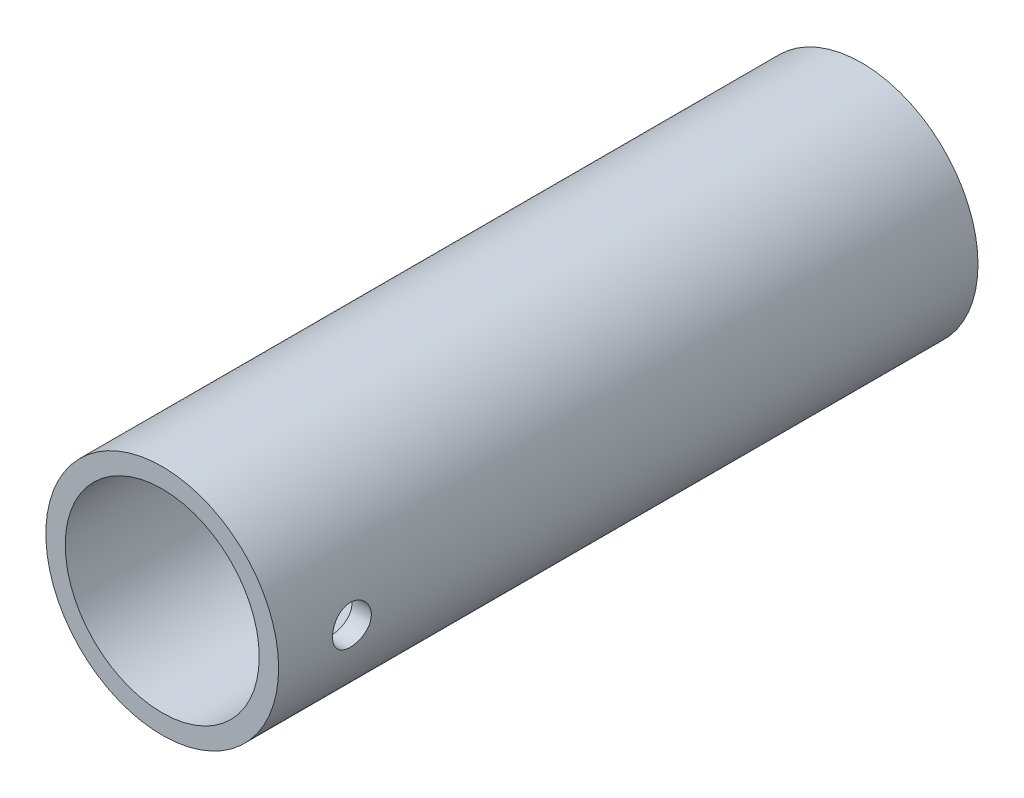
ISO-10303-21;
HEADER;
FILE_DESCRIPTION(('STEP AP214'),'2;1');
FILE_NAME('part.step','',(''),(''),'','','');
FILE_SCHEMA(('AUTOMOTIVE_DESIGN { 1 0 10303 214 1 1 1 1 }'));
ENDSEC;
DATA;
#1=APPLICATION_CONTEXT('core data for automotive mechanical design processes');
#2=APPLICATION_PROTOCOL_DEFINITION('international standard','automotive_design',2000,#1);
#3=PRODUCT_CONTEXT('',#1,'mechanical');
#4=PRODUCT('Part','Part','',(#3));
#5=PRODUCT_RELATED_PRODUCT_CATEGORY('part','',(#4));
#6=PRODUCT_DEFINITION_FORMATION('','',#4);
#7=PRODUCT_DEFINITION_CONTEXT('part definition',#1,'design');
#8=PRODUCT_DEFINITION('design','',#6,#7);
#9=PRODUCT_DEFINITION_SHAPE('','',#8);
#10=(LENGTH_UNIT() NAMED_UNIT(*) SI_UNIT(.MILLI.,.METRE.));
#11=(NAMED_UNIT(*) PLANE_ANGLE_UNIT() SI_UNIT($,.RADIAN.));
#12=(NAMED_UNIT(*) SI_UNIT($,.STERADIAN.) SOLID_ANGLE_UNIT());
#13=UNCERTAINTY_MEASURE_WITH_UNIT(LENGTH_MEASURE(1.E-05),#10,'distance_accuracy_value','');
#14=(GEOMETRIC_REPRESENTATION_CONTEXT(3) GLOBAL_UNCERTAINTY_ASSIGNED_CONTEXT((#13)) GLOBAL_UNIT_ASSIGNED_CONTEXT((#10,
#11,#12)) REPRESENTATION_CONTEXT('',''));
#15=CARTESIAN_POINT('',(0.,0.,0.));
#16=DIRECTION('',(0.,0.,1.));
#17=DIRECTION('',(1.,0.,0.));
#18=AXIS2_PLACEMENT_3D('',#15,#16,#17);
#19=CARTESIAN_POINT('',(0.,0.,57.23999991144));
#20=DIRECTION('',(0.,0.,1.));
#21=DIRECTION('',(1.,0.,0.));
#22=AXIS2_PLACEMENT_3D('',#19,#20,#21);
#23=PLANE('',#22);
#24=CARTESIAN_POINT('',(0.,0.,57.23999991144));
#25=DIRECTION('',(0.,0.,1.));
#26=DIRECTION('',(1.,0.,0.));
#27=AXIS2_PLACEMENT_3D('',#24,#25,#26);
#28=CIRCLE('',#27,9.525);
#29=CARTESIAN_POINT('',(9.525,0.,57.23999991144));
#30=VERTEX_POINT('',#29);
#31=EDGE_CURVE('E11',#30,#30,#28,.T.);
#32=ORIENTED_EDGE('',*,*,#31,.T.);
#33=EDGE_LOOP('',(#32));
#34=FACE_BOUND('',#33,.T.);
#35=CARTESIAN_POINT('',(0.,0.,57.23999991144));
#36=DIRECTION('',(0.,0.,1.));
#37=DIRECTION('',(1.,0.,0.));
#38=AXIS2_PLACEMENT_3D('',#35,#36,#37);
#39=CIRCLE('',#38,7.9375);
#40=CARTESIAN_POINT('',(7.9375,0.,57.23999991144));
#41=VERTEX_POINT('',#40);
#42=EDGE_CURVE('E164',#41,#41,#39,.T.);
#43=ORIENTED_EDGE('',*,*,#42,.F.);
#44=EDGE_LOOP('',(#43));
#45=FACE_BOUND('',#44,.T.);
#46=ADVANCED_FACE('F32',(#34,#45),#23,.T.);
#47=CARTESIAN_POINT('',(0.,0.,0.));
#48=DIRECTION('',(0.,0.,1.));
#49=DIRECTION('',(1.,0.,0.));
#50=AXIS2_PLACEMENT_3D('',#47,#48,#49);
#51=PLANE('',#50);
#52=CARTESIAN_POINT('',(0.,0.,0.));
#53=DIRECTION('',(0.,0.,1.));
#54=DIRECTION('',(1.,0.,0.));
#55=AXIS2_PLACEMENT_3D('',#52,#53,#54);
#56=CIRCLE('',#55,9.525);
#57=CARTESIAN_POINT('',(9.525,0.,0.));
#58=VERTEX_POINT('',#57);
#59=EDGE_CURVE('E36',#58,#58,#56,.T.);
#60=ORIENTED_EDGE('',*,*,#59,.F.);
#61=EDGE_LOOP('',(#60));
#62=FACE_BOUND('',#61,.T.);
#63=CARTESIAN_POINT('',(0.,0.,0.));
#64=DIRECTION('',(0.,0.,1.));
#65=DIRECTION('',(1.,0.,0.));
#66=AXIS2_PLACEMENT_3D('',#63,#64,#65);
#67=CIRCLE('',#66,7.9375);
#68=CARTESIAN_POINT('',(7.9375,0.,0.));
#69=VERTEX_POINT('',#68);
#70=EDGE_CURVE('E167',#69,#69,#67,.T.);
#71=ORIENTED_EDGE('',*,*,#70,.T.);
#72=EDGE_LOOP('',(#71));
#73=FACE_BOUND('',#72,.T.);
#74=ADVANCED_FACE('F141',(#62,#73),#51,.F.);
#75=CARTESIAN_POINT('',(0.,0.,57.23999991144));
#76=DIRECTION('',(0.,0.,-1.));
#77=DIRECTION('',(-1.,0.,0.));
#78=AXIS2_PLACEMENT_3D('',#75,#76,#77);
#79=CYLINDRICAL_SURFACE('',#78,9.525);
#80=CARTESIAN_POINT('',(0.,0.,13.));
#81=DIRECTION('',(0.,0.,-1.));
#82=DIRECTION('',(-1.,0.,0.));
#83=AXIS2_PLACEMENT_3D('',#80,#81,#82);
#84=CIRCLE('',#83,9.525);
#85=CARTESIAN_POINT('',(-6.96244389564469,6.5,13.));
#86=VERTEX_POINT('',#85);
#87=CARTESIAN_POINT('',(-6.45953752214506,-7.,13.));
#88=VERTEX_POINT('',#87);
#89=EDGE_CURVE('E79',#86,#88,#84,.F.);
#90=ORIENTED_EDGE('',*,*,#89,.F.);
#91=DIRECTION('',(0.,0.,-1.));
#92=VECTOR('',#91,1.);
#93=CARTESIAN_POINT('',(-6.96244389564469,6.5,57.23999991144));
#94=LINE('',#93,#92);
#95=CARTESIAN_POINT('',(-6.96244389564469,6.5,40.23999991144));
#96=VERTEX_POINT('',#95);
#97=EDGE_CURVE('E87',#96,#86,#94,.T.);
#98=ORIENTED_EDGE('',*,*,#97,.F.);
#99=CARTESIAN_POINT('',(0.,0.,40.23999991144));
#100=DIRECTION('',(0.,0.,1.));
#101=DIRECTION('',(1.,0.,0.));
#102=AXIS2_PLACEMENT_3D('',#99,#100,#101);
#103=CIRCLE('',#102,9.525);
#104=CARTESIAN_POINT('',(-6.45953752214507,-7.,40.23999991144));
#105=VERTEX_POINT('',#104);
#106=EDGE_CURVE('E94',#105,#96,#103,.F.);
#107=ORIENTED_EDGE('',*,*,#106,.F.);
#108=DIRECTION('',(0.,0.,-1.));
#109=VECTOR('',#108,1.);
#110=CARTESIAN_POINT('',(-6.45953752214506,-7.,57.23999991144));
#111=LINE('',#110,#109);
#112=EDGE_CURVE('E47',#88,#105,#111,.F.);
#113=ORIENTED_EDGE('',*,*,#112,.F.);
#114=EDGE_LOOP('',(#90,#98,#107,#113));
#115=FACE_BOUND('',#114,.T.);
#116=CARTESIAN_POINT('',(9.525,0.,49.65249991144));
#117=CARTESIAN_POINT('',(9.52499848342203,0.0885132246484669,49.6525034604219));
#118=CARTESIAN_POINT('',(9.52375335474776,0.177074754967652,49.6599276810453));
#119=CARTESIAN_POINT('',(9.51890619037781,0.351713940762383,49.689416054756));
#120=CARTESIAN_POINT('',(9.5153019874167,0.437789236154122,49.7114936700789));
#121=CARTESIAN_POINT('',(9.50614093330146,0.604904014480029,49.7696037212964));
#122=CARTESIAN_POINT('',(9.50058567976088,0.685947553954258,49.8056247421218));
#123=CARTESIAN_POINT('',(9.48813334197115,0.840830069655997,49.8905692168933));
#124=CARTESIAN_POINT('',(9.48123641121565,0.914669868572907,49.9394911951417));
#125=CARTESIAN_POINT('',(9.46679156586029,1.05376511007522,50.049346389666));
#126=CARTESIAN_POINT('',(9.45923858602434,1.1189416937447,50.1103787992339));
#127=CARTESIAN_POINT('',(9.44437168066725,1.23817919664905,50.2425088714202));
#128=CARTESIAN_POINT('',(9.43705777026294,1.29223941411327,50.3136071690149));
#129=CARTESIAN_POINT('',(9.42344804257461,1.38802562475926,50.4643924749751));
#130=CARTESIAN_POINT('',(9.41715876973189,1.42967364106673,50.544129660311));
#131=CARTESIAN_POINT('',(9.40638066519618,1.49895456203612,50.7095904847709));
#132=CARTESIAN_POINT('',(9.40189171189085,1.52658841339416,50.7953137190753));
#133=CARTESIAN_POINT('',(9.3952729089515,1.56680812989335,50.9694773859739));
#134=CARTESIAN_POINT('',(9.39312172988419,1.57953013350098,51.0578855541184));
#135=CARTESIAN_POINT('',(9.39135751224772,1.58998712055907,51.235605887261));
#136=CARTESIAN_POINT('',(9.39174429405331,1.58772316464701,51.3249179878362));
#137=CARTESIAN_POINT('',(9.39499282328357,1.56838338748155,51.5009391033499));
#138=CARTESIAN_POINT('',(9.39782901557512,1.5514605,51.5876654616912));
#139=CARTESIAN_POINT('',(9.4056167945899,1.50352324415618,51.7570304482615));
#140=CARTESIAN_POINT('',(9.41056845386527,1.47250839249303,51.8396689361842));
#141=CARTESIAN_POINT('',(9.42205684377153,1.39711255126963,51.998970214325));
#142=CARTESIAN_POINT('',(9.42860107613152,1.35266805531362,52.0756023843016));
#143=CARTESIAN_POINT('',(9.44253203193531,1.25171963114897,52.2203792057819));
#144=CARTESIAN_POINT('',(9.44991882335472,1.19521472961547,52.2885231715489));
#145=CARTESIAN_POINT('',(9.46481487703664,1.07091620472099,52.4152744759277));
#146=CARTESIAN_POINT('',(9.47232452262099,1.00299136705943,52.4737531707129));
#147=CARTESIAN_POINT('',(9.48653551886919,0.858224883103343,52.5785022907325));
#148=CARTESIAN_POINT('',(9.49323686432489,0.781383179360574,52.6247726373064));
#149=CARTESIAN_POINT('',(9.50508571986999,0.620843256765857,52.7038033256715));
#150=CARTESIAN_POINT('',(9.51023192188729,0.537139340733554,52.7365523027153));
#151=CARTESIAN_POINT('',(9.51838014413039,0.365314449457729,52.7874912381212));
#152=CARTESIAN_POINT('',(9.52138234372551,0.277193844378958,52.8056824144183));
#153=CARTESIAN_POINT('',(9.52488017450106,0.100145787326528,52.8268149740628));
#154=CARTESIAN_POINT('',(9.52540483163118,0.0112399680908891,52.8299329595365));
#155=CARTESIAN_POINT('',(9.52396796257443,-0.165823755785082,52.8213014577281));
#156=CARTESIAN_POINT('',(9.52200653204815,-0.253981689071448,52.8095525425001));
#157=CARTESIAN_POINT('',(9.51583585105758,-0.426501671472197,52.771667632112));
#158=CARTESIAN_POINT('',(9.51164026548833,-0.510883451424716,52.7456190691123));
#159=CARTESIAN_POINT('',(9.50146984929153,-0.674082271886381,52.6799674923833));
#160=CARTESIAN_POINT('',(9.49549491875132,-0.752898999602672,52.6403637174916));
#161=CARTESIAN_POINT('',(9.48235667852029,-0.903497487812789,52.5483214472575));
#162=CARTESIAN_POINT('',(9.47518333488259,-0.975210934345088,52.4957726372738));
#163=CARTESIAN_POINT('',(9.46047426793857,-1.1088646767942,52.3794837161705));
#164=CARTESIAN_POINT('',(9.45293851833932,-1.17080426220733,52.3157427921593));
#165=CARTESIAN_POINT('',(9.43826011274762,-1.28380666508283,52.1780869684146));
#166=CARTESIAN_POINT('',(9.43112233747062,-1.33475016330721,52.1040735163383));
#167=CARTESIAN_POINT('',(9.41813921408956,-1.42348096703731,51.948435776037));
#168=CARTESIAN_POINT('',(9.41229382501923,-1.46126868957884,51.8668117291705));
#169=CARTESIAN_POINT('',(9.40259393098042,-1.52243684048545,51.6986034311043));
#170=CARTESIAN_POINT('',(9.39873122987526,-1.54587665966794,51.6120412710956));
#171=CARTESIAN_POINT('',(9.39341350190391,-1.5778705131492,51.4361386293842));
#172=CARTESIAN_POINT('',(9.39195826572028,-1.58642584158582,51.3467983899101));
#173=CARTESIAN_POINT('',(9.39162925508347,-1.58837176994007,51.1690671310539));
#174=CARTESIAN_POINT('',(9.39272350881088,-1.58195018643949,51.0806781710447));
#175=CARTESIAN_POINT('',(9.39730011223118,-1.5545306977376,50.9062570889278));
#176=CARTESIAN_POINT('',(9.40078245418371,-1.53353283978142,50.8202249591819));
#177=CARTESIAN_POINT('',(9.40973071238892,-1.47762880089276,50.6530323037592));
#178=CARTESIAN_POINT('',(9.4151943218449,-1.44273879003128,50.5718662400544));
#179=CARTESIAN_POINT('',(9.42749174265602,-1.3600601474866,50.4165092615013));
#180=CARTESIAN_POINT('',(9.43432562196633,-1.31227087605534,50.3423186928537));
#181=CARTESIAN_POINT('',(9.4486949331897,-1.20447999157632,50.2020698161666));
#182=CARTESIAN_POINT('',(9.45623772690952,-1.14434020788196,50.1361184408353));
#183=CARTESIAN_POINT('',(9.47111626449134,-1.01384673492644,50.0151791425984));
#184=CARTESIAN_POINT('',(9.47845196016857,-0.943490691699519,49.9601937533548));
#185=CARTESIAN_POINT('',(9.4921484632281,-0.793984422721574,49.862400261133));
#186=CARTESIAN_POINT('',(9.49850218820721,-0.714776820083336,49.8196788764763));
#187=CARTESIAN_POINT('',(9.50944991427127,-0.550235799055649,49.7482137887127));
#188=CARTESIAN_POINT('',(9.51404566692701,-0.464908579217052,49.7194561649544));
#189=CARTESIAN_POINT('',(9.51995677178927,-0.316041601878825,49.6829765623696));
#190=CARTESIAN_POINT('',(9.52183787318583,-0.25340235723951,49.6715661232339));
#191=CARTESIAN_POINT('',(9.52436002151187,-0.127183712053077,49.6563265879086));
#192=CARTESIAN_POINT('',(9.52500108979108,-0.0636043277113929,49.6524973611928));
#193=CARTESIAN_POINT('',(9.525,0.,49.65249991144));
#194=B_SPLINE_CURVE_WITH_KNOTS('',3,(#116,#117,#118,#119,#120,#121,#122,#123,#124,#125,#126,
#127,#128,#129,#130,#131,#132,#133,#134,#135,#136,#137,#138,#139,#140,#141,#142,#143,#144,#145,
#146,#147,#148,#149,#150,#151,#152,#153,#154,#155,#156,#157,#158,#159,#160,#161,#162,#163,#164,
#165,#166,#167,#168,#169,#170,#171,#172,#173,#174,#175,#176,#177,#178,#179,#180,#181,#182,#183,
#184,#185,#186,#187,#188,#189,#190,#191,#192,#193),.UNSPECIFIED.,.T.,.F.,(4,2,2,2,2,2,2,2,2,2,2,
2,2,2,2,2,2,2,2,2,2,2,2,2,2,2,2,2,2,2,2,2,2,2,2,2,2,2,4),(0.,0.265307181435955,
0.530858441516593,0.796192760561046,1.0614967420485,1.3290708182458,1.59666178107859,
1.86590000723138,2.13512004316375,2.40186258960675,2.66858625743763,2.9325603131786,
3.19654342291118,3.46179493461674,3.72706786132164,3.99562808893692,4.26419004688763,
4.53297727461599,4.80174201270929,5.06735006017037,5.33294788777771,5.59693957449073,
5.86094608749552,6.12728534273159,6.39364395039469,6.66276176974838,6.93187105733723,
7.19985874187023,7.46782312494502,7.73244522546914,7.99706646829464,8.26138059573651,
8.52570783443629,8.79317128962804,9.06069647013147,9.33006917070572,9.59917277602596,
9.78982197584151,9.98046789320874),.UNSPECIFIED.);
#195=CARTESIAN_POINT('',(9.525,0.,49.65249991144));
#196=VERTEX_POINT('',#195);
#197=EDGE_CURVE('E111',#196,#196,#194,.T.);
#198=ORIENTED_EDGE('',*,*,#197,.F.);
#199=EDGE_LOOP('',(#198));
#200=FACE_BOUND('',#199,.T.);
#201=ORIENTED_EDGE('',*,*,#31,.F.);
#202=EDGE_LOOP('',(#201));
#203=FACE_BOUND('',#202,.T.);
#204=ORIENTED_EDGE('',*,*,#59,.T.);
#205=EDGE_LOOP('',(#204));
#206=FACE_BOUND('',#205,.T.);
#207=ADVANCED_FACE('F34',(#115,#200,#203,#206),#79,.T.);
#208=CARTESIAN_POINT('',(0.,0.,57.23999991144));
#209=DIRECTION('',(0.,0.,-1.));
#210=DIRECTION('',(-1.,0.,0.));
#211=AXIS2_PLACEMENT_3D('',#208,#209,#210);
#212=CYLINDRICAL_SURFACE('',#211,7.9375);
#213=DIRECTION('',(0.,0.,-1.));
#214=VECTOR('',#213,1.);
#215=CARTESIAN_POINT('',(-4.55564553603548,6.5,57.23999991144));
#216=LINE('',#215,#214);
#217=CARTESIAN_POINT('',(-4.55564553603548,6.5,40.23999991144));
#218=VERTEX_POINT('',#217);
#219=CARTESIAN_POINT('',(-4.55564553603548,6.5,13.));
#220=VERTEX_POINT('',#219);
#221=EDGE_CURVE('E107',#218,#220,#216,.T.);
#222=ORIENTED_EDGE('',*,*,#221,.T.);
#223=CARTESIAN_POINT('',(0.,0.,13.));
#224=DIRECTION('',(0.,0.,-1.));
#225=DIRECTION('',(-1.,0.,0.));
#226=AXIS2_PLACEMENT_3D('',#223,#224,#225);
#227=CIRCLE('',#226,7.9375);
#228=CARTESIAN_POINT('',(-3.74217934498068,-7.,13.));
#229=VERTEX_POINT('',#228);
#230=EDGE_CURVE('E81',#220,#229,#227,.F.);
#231=ORIENTED_EDGE('',*,*,#230,.T.);
#232=DIRECTION('',(0.,0.,-1.));
#233=VECTOR('',#232,1.);
#234=CARTESIAN_POINT('',(-3.74217934498068,-7.,57.23999991144));
#235=LINE('',#234,#233);
#236=CARTESIAN_POINT('',(-3.74217934498068,-7.,40.23999991144));
#237=VERTEX_POINT('',#236);
#238=EDGE_CURVE('E99',#229,#237,#235,.F.);
#239=ORIENTED_EDGE('',*,*,#238,.T.);
#240=CARTESIAN_POINT('',(0.,0.,40.23999991144));
#241=DIRECTION('',(0.,0.,1.));
#242=DIRECTION('',(1.,0.,0.));
#243=AXIS2_PLACEMENT_3D('',#240,#241,#242);
#244=CIRCLE('',#243,7.9375);
#245=EDGE_CURVE('E102',#237,#218,#244,.F.);
#246=ORIENTED_EDGE('',*,*,#245,.T.);
#247=EDGE_LOOP('',(#222,#231,#239,#246));
#248=FACE_BOUND('',#247,.T.);
#249=CARTESIAN_POINT('',(7.9375,0.,49.65249991144));
#250=CARTESIAN_POINT('',(7.93749837409633,0.0882283395333057,49.6525031570811));
#251=CARTESIAN_POINT('',(7.93601386470442,0.176497710569918,49.6598799496511));
#252=CARTESIAN_POINT('',(7.9302350542688,0.350541443456319,49.6891687803729));
#253=CARTESIAN_POINT('',(7.92593852103046,0.436313766596903,49.7110923660124));
#254=CARTESIAN_POINT('',(7.9150154322928,0.602821859605509,49.768770433313));
#255=CARTESIAN_POINT('',(7.9083911090929,0.683562367843849,49.8045116674309));
#256=CARTESIAN_POINT('',(7.89353256881061,0.837895182321957,49.8887711043642));
#257=CARTESIAN_POINT('',(7.88529844761685,0.911487913932851,49.9372885462164));
#258=CARTESIAN_POINT('',(7.86800187461327,1.05043839523735,50.0464197711276));
#259=CARTESIAN_POINT('',(7.85893058488151,1.11568539746416,50.1071731756235));
#260=CARTESIAN_POINT('',(7.84104636468484,1.23513335111525,50.2387516224618));
#261=CARTESIAN_POINT('',(7.83223345444423,1.28933343982305,50.3095774506845));
#262=CARTESIAN_POINT('',(7.81577751377527,1.38562040843935,50.4600868678463));
#263=CARTESIAN_POINT('',(7.80814585441852,1.42759261544956,50.5398451709667));
#264=CARTESIAN_POINT('',(7.79504200542738,1.49749774569624,50.705459799109));
#265=CARTESIAN_POINT('',(7.78956960247114,1.52543205586912,50.7913155207523));
#266=CARTESIAN_POINT('',(7.78149328337875,1.56610891356716,50.9654963391438));
#267=CARTESIAN_POINT('',(7.7788527129516,1.57904576550956,51.0537743252658));
#268=CARTESIAN_POINT('',(7.77662870408746,1.58996400276521,51.2312842528559));
#269=CARTESIAN_POINT('',(7.77704495305197,1.58794691730768,51.3205160958482));
#270=CARTESIAN_POINT('',(7.78085424947743,1.56917163479913,51.4959791874233));
#271=CARTESIAN_POINT('',(7.78420231413287,1.5526361826372,51.5822353928734));
#272=CARTESIAN_POINT('',(7.79342717029002,1.50564514183909,51.7507241831425));
#273=CARTESIAN_POINT('',(7.79930408255474,1.47518888842233,51.8329565755989));
#274=CARTESIAN_POINT('',(7.81297044369398,1.40100809408361,51.9917053893945));
#275=CARTESIAN_POINT('',(7.82077255079256,1.35719526508098,52.0681794202561));
#276=CARTESIAN_POINT('',(7.83740207302236,1.25760729963412,52.2127736357718));
#277=CARTESIAN_POINT('',(7.84622960593406,1.20183078841646,52.2808928589412));
#278=CARTESIAN_POINT('',(7.86411021220821,1.07870614611492,52.4081290878404));
#279=CARTESIAN_POINT('',(7.87316448622312,1.01116790592475,52.4670621129164));
#280=CARTESIAN_POINT('',(7.89033297334124,0.867068725698435,52.5727916424432));
#281=CARTESIAN_POINT('',(7.89844717438746,0.790507669964777,52.6195879912436));
#282=CARTESIAN_POINT('',(7.91284120630408,0.630331776670285,52.6997498323362));
#283=CARTESIAN_POINT('',(7.91911816046632,0.546706138591662,52.7330942926007));
#284=CARTESIAN_POINT('',(7.92910861768225,0.374886500112253,52.7852096639762));
#285=CARTESIAN_POINT('',(7.93282243125844,0.286693054490013,52.8039823404819));
#286=CARTESIAN_POINT('',(7.93722491588653,0.109822306433101,52.8261607818384));
#287=CARTESIAN_POINT('',(7.93796314760796,0.0211777712168517,52.8298183274602));
#288=CARTESIAN_POINT('',(7.93646894939038,-0.155455833030934,52.8223407603693));
#289=CARTESIAN_POINT('',(7.93423668644546,-0.243444938629523,52.8112064792177));
#290=CARTESIAN_POINT('',(7.92708333312728,-0.415457735165135,52.774670493439));
#291=CARTESIAN_POINT('',(7.92218660041678,-0.499509967989598,52.7493979776996));
#292=CARTESIAN_POINT('',(7.9102513889689,-0.662183758655723,52.6854440889739));
#293=CARTESIAN_POINT('',(7.90321274977585,-0.740804909099595,52.6467617113905));
#294=CARTESIAN_POINT('',(7.88765109559105,-0.89144661322687,52.556541457531));
#295=CARTESIAN_POINT('',(7.8791109631882,-0.963374576219097,52.5048519965407));
#296=CARTESIAN_POINT('',(7.86153391542438,-1.09762610535174,52.3902878203984));
#297=CARTESIAN_POINT('',(7.85249694687316,-1.15994864042759,52.3274119060302));
#298=CARTESIAN_POINT('',(7.83477769396682,-1.27419193785401,52.1911134653128));
#299=CARTESIAN_POINT('',(7.82610290620371,-1.32593985263724,52.1175449174886));
#300=CARTESIAN_POINT('',(7.81024904476459,-1.41634435433129,51.9626118752863));
#301=CARTESIAN_POINT('',(7.80306991124931,-1.45500146502761,51.881247692992));
#302=CARTESIAN_POINT('',(7.79108075677708,-1.51789104851136,51.7134428206776));
#303=CARTESIAN_POINT('',(7.78625847609596,-1.54219830591829,51.6270310760186));
#304=CARTESIAN_POINT('',(7.7795030590734,-1.57592498445817,51.4512430540232));
#305=CARTESIAN_POINT('',(7.77756954597139,-1.58534634705736,51.3618671648327));
#306=CARTESIAN_POINT('',(7.77683150039814,-1.5889619460021,51.1844233389759));
#307=CARTESIAN_POINT('',(7.77797084213015,-1.58342931356255,51.0963610875184));
#308=CARTESIAN_POINT('',(7.78312472906825,-1.55789678275884,50.9224496672158));
#309=CARTESIAN_POINT('',(7.78713925117881,-1.53789700060526,50.8366004805995));
#310=CARTESIAN_POINT('',(7.79756606947914,-1.48411972749209,50.6697259198456));
#311=CARTESIAN_POINT('',(7.80397253367393,-1.45037572941378,50.5886893641424));
#312=CARTESIAN_POINT('',(7.81846472521495,-1.37009924830504,50.4333852547741));
#313=CARTESIAN_POINT('',(7.82655059335744,-1.32356569293012,50.3591182694013));
#314=CARTESIAN_POINT('',(7.8436622483062,-1.21809813972343,50.2181014406514));
#315=CARTESIAN_POINT('',(7.85270166994148,-1.15896689598584,50.1515007465777));
#316=CARTESIAN_POINT('',(7.87060404971728,-1.03038968580836,50.0290768101624));
#317=CARTESIAN_POINT('',(7.87946696682805,-0.960941352105916,49.9732560480613));
#318=CARTESIAN_POINT('',(7.89612708915905,-0.812827986177591,49.873424914175));
#319=CARTESIAN_POINT('',(7.90391217060553,-0.734074104032361,49.829544256233));
#320=CARTESIAN_POINT('',(7.91742011072437,-0.57017659799341,49.7557094418179));
#321=CARTESIAN_POINT('',(7.92314482707553,-0.485038814120209,49.7257427330572));
#322=CARTESIAN_POINT('',(7.93077491495151,-0.333091613666496,49.686389943919));
#323=CARTESIAN_POINT('',(7.93328206264042,-0.26714714162188,49.6737038414289));
#324=CARTESIAN_POINT('',(7.9366451969708,-0.13414299627098,49.6567577255711));
#325=CARTESIAN_POINT('',(7.93750123623634,-0.0670833585759322,49.6524974436557));
#326=CARTESIAN_POINT('',(7.9375,0.,49.65249991144));
#327=B_SPLINE_CURVE_WITH_KNOTS('',3,(#249,#250,#251,#252,#253,#254,#255,#256,#257,#258,#259,
#260,#261,#262,#263,#264,#265,#266,#267,#268,#269,#270,#271,#272,#273,#274,#275,#276,#277,#278,
#279,#280,#281,#282,#283,#284,#285,#286,#287,#288,#289,#290,#291,#292,#293,#294,#295,#296,#297,
#298,#299,#300,#301,#302,#303,#304,#305,#306,#307,#308,#309,#310,#311,#312,#313,#314,#315,#316,
#317,#318,#319,#320,#321,#322,#323,#324,#325,#326),.UNSPECIFIED.,.T.,.F.,(4,2,2,2,2,2,2,2,2,2,2,
2,2,2,2,2,2,2,2,2,2,2,2,2,2,2,2,2,2,2,2,2,2,2,2,2,2,2,4),(0.,0.264439607424749,
0.529089382972476,0.793486054709918,1.05786698229149,1.3254556138031,1.59306513483645,
1.86310897071903,2.13312612117251,2.39960443851944,2.66605550546446,2.92848866622468,
3.19093436065296,3.45515390698204,3.71940383165102,3.9884072583002,4.25741413469465,
4.52683998830763,4.79623319545632,5.06112042886071,5.32599277156865,5.58848345646773,
5.85099381005435,6.11671792327956,6.38247053999164,6.65226997869521,6.92205862098504,
7.19042854889448,7.45876347224533,7.72223059576226,7.98569560294515,8.24852238489311,
8.51137121036213,8.7786857102964,9.04606164071026,9.31623575972573,9.5861656688406,
9.78723555772706,9.98829903801456),.UNSPECIFIED.);
#328=CARTESIAN_POINT('',(7.9375,0.,49.65249991144));
#329=VERTEX_POINT('',#328);
#330=EDGE_CURVE('E118',#329,#329,#327,.T.);
#331=ORIENTED_EDGE('',*,*,#330,.T.);
#332=EDGE_LOOP('',(#331));
#333=FACE_BOUND('',#332,.T.);
#334=ORIENTED_EDGE('',*,*,#42,.T.);
#335=EDGE_LOOP('',(#334));
#336=FACE_BOUND('',#335,.T.);
#337=ORIENTED_EDGE('',*,*,#70,.F.);
#338=EDGE_LOOP('',(#337));
#339=FACE_BOUND('',#338,.T.);
#340=ADVANCED_FACE('F149',(#248,#333,#336,#339),#212,.F.);
#341=CARTESIAN_POINT('',(-9.526,0.,51.23999991144));
#342=DIRECTION('',(1.,0.,0.));
#343=DIRECTION('',(0.,0.,-1.));
#344=AXIS2_PLACEMENT_3D('',#341,#342,#343);
#345=CYLINDRICAL_SURFACE('',#344,1.5875);
#346=ORIENTED_EDGE('',*,*,#330,.F.);
#347=EDGE_LOOP('',(#346));
#348=FACE_BOUND('',#347,.T.);
#349=ORIENTED_EDGE('',*,*,#197,.T.);
#350=EDGE_LOOP('',(#349));
#351=FACE_BOUND('',#350,.T.);
#352=ADVANCED_FACE('F123',(#348,#351),#345,.F.);
#353=CARTESIAN_POINT('',(9.526,6.5,13.));
#354=DIRECTION('',(0.,1.,0.));
#355=DIRECTION('',(0.,0.,1.));
#356=AXIS2_PLACEMENT_3D('',#353,#354,#355);
#357=PLANE('',#356);
#358=ORIENTED_EDGE('',*,*,#97,.T.);
#359=DIRECTION('',(-1.,0.,0.));
#360=VECTOR('',#359,1.);
#361=CARTESIAN_POINT('',(9.526,6.5,13.));
#362=LINE('',#361,#360);
#363=EDGE_CURVE('E74',#220,#86,#362,.T.);
#364=ORIENTED_EDGE('',*,*,#363,.F.);
#365=ORIENTED_EDGE('',*,*,#221,.F.);
#366=DIRECTION('',(-1.,0.,0.));
#367=VECTOR('',#366,1.);
#368=CARTESIAN_POINT('',(9.526,6.5,40.23999991144));
#369=LINE('',#368,#367);
#370=EDGE_CURVE('E55',#218,#96,#369,.T.);
#371=ORIENTED_EDGE('',*,*,#370,.T.);
#372=EDGE_LOOP('',(#358,#364,#365,#371));
#373=FACE_BOUND('',#372,.T.);
#374=ADVANCED_FACE('F88',(#373),#357,.F.);
#375=CARTESIAN_POINT('',(9.526,-7.,13.));
#376=DIRECTION('',(0.,0.,-1.));
#377=DIRECTION('',(-1.,0.,0.));
#378=AXIS2_PLACEMENT_3D('',#375,#376,#377);
#379=PLANE('',#378);
#380=ORIENTED_EDGE('',*,*,#89,.T.);
#381=DIRECTION('',(-1.,0.,0.));
#382=VECTOR('',#381,1.);
#383=CARTESIAN_POINT('',(9.526,-7.,13.));
#384=LINE('',#383,#382);
#385=EDGE_CURVE('E84',#229,#88,#384,.T.);
#386=ORIENTED_EDGE('',*,*,#385,.F.);
#387=ORIENTED_EDGE('',*,*,#230,.F.);
#388=ORIENTED_EDGE('',*,*,#363,.T.);
#389=EDGE_LOOP('',(#380,#386,#387,#388));
#390=FACE_BOUND('',#389,.T.);
#391=ADVANCED_FACE('F76',(#390),#379,.F.);
#392=CARTESIAN_POINT('',(9.526,-7.,13.));
#393=DIRECTION('',(0.,-1.,0.));
#394=DIRECTION('',(0.,0.,-1.));
#395=AXIS2_PLACEMENT_3D('',#392,#393,#394);
#396=PLANE('',#395);
#397=ORIENTED_EDGE('',*,*,#112,.T.);
#398=DIRECTION('',(-1.,0.,0.));
#399=VECTOR('',#398,1.);
#400=CARTESIAN_POINT('',(9.526,-7.,40.23999991144));
#401=LINE('',#400,#399);
#402=EDGE_CURVE('E105',#237,#105,#401,.T.);
#403=ORIENTED_EDGE('',*,*,#402,.F.);
#404=ORIENTED_EDGE('',*,*,#238,.F.);
#405=ORIENTED_EDGE('',*,*,#385,.T.);
#406=EDGE_LOOP('',(#397,#403,#404,#405));
#407=FACE_BOUND('',#406,.T.);
#408=ADVANCED_FACE('F132',(#407),#396,.F.);
#409=CARTESIAN_POINT('',(9.526,-7.,40.23999991144));
#410=DIRECTION('',(0.,0.,1.));
#411=DIRECTION('',(1.,0.,0.));
#412=AXIS2_PLACEMENT_3D('',#409,#410,#411);
#413=PLANE('',#412);
#414=ORIENTED_EDGE('',*,*,#106,.T.);
#415=ORIENTED_EDGE('',*,*,#370,.F.);
#416=ORIENTED_EDGE('',*,*,#245,.F.);
#417=ORIENTED_EDGE('',*,*,#402,.T.);
#418=EDGE_LOOP('',(#414,#415,#416,#417));
#419=FACE_BOUND('',#418,.T.);
#420=ADVANCED_FACE('F129',(#419),#413,.F.);
#421=CLOSED_SHELL('',(#46,#74,#207,#340,#352,#374,#391,#408,#420));
#422=MANIFOLD_SOLID_BREP('B2',#421);
#423=ADVANCED_BREP_SHAPE_REPRESENTATION('',(#18,#422),#14);
#424=SHAPE_DEFINITION_REPRESENTATION(#9,#423);
ENDSEC;
END-ISO-10303-21;
